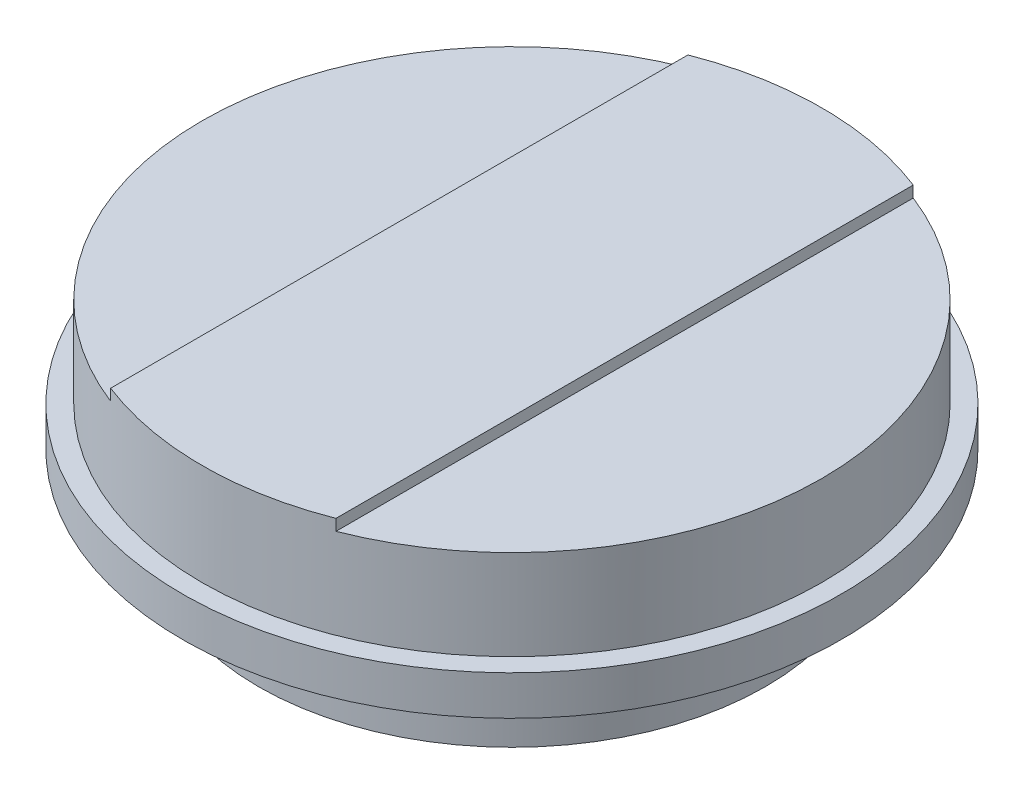
ISO-10303-21;
HEADER;
FILE_DESCRIPTION(('STEP AP214'),'2;1');
FILE_NAME('part.step','',(''),(''),'','','');
FILE_SCHEMA(('AUTOMOTIVE_DESIGN { 1 0 10303 214 1 1 1 1 }'));
ENDSEC;
DATA;
#1=APPLICATION_CONTEXT('core data for automotive mechanical design processes');
#2=APPLICATION_PROTOCOL_DEFINITION('international standard','automotive_design',2000,#1);
#3=PRODUCT_CONTEXT('',#1,'mechanical');
#4=PRODUCT('Part','Part','',(#3));
#5=PRODUCT_RELATED_PRODUCT_CATEGORY('part','',(#4));
#6=PRODUCT_DEFINITION_FORMATION('','',#4);
#7=PRODUCT_DEFINITION_CONTEXT('part definition',#1,'design');
#8=PRODUCT_DEFINITION('design','',#6,#7);
#9=PRODUCT_DEFINITION_SHAPE('','',#8);
#10=(LENGTH_UNIT() NAMED_UNIT(*) SI_UNIT(.MILLI.,.METRE.));
#11=(NAMED_UNIT(*) PLANE_ANGLE_UNIT() SI_UNIT($,.RADIAN.));
#12=(NAMED_UNIT(*) SI_UNIT($,.STERADIAN.) SOLID_ANGLE_UNIT());
#13=UNCERTAINTY_MEASURE_WITH_UNIT(LENGTH_MEASURE(1.E-05),#10,'distance_accuracy_value','');
#14=(GEOMETRIC_REPRESENTATION_CONTEXT(3) GLOBAL_UNCERTAINTY_ASSIGNED_CONTEXT((#13)) GLOBAL_UNIT_ASSIGNED_CONTEXT((#10,
#11,#12)) REPRESENTATION_CONTEXT('',''));
#15=CARTESIAN_POINT('',(0.,0.,0.));
#16=DIRECTION('',(0.,0.,1.));
#17=DIRECTION('',(1.,0.,0.));
#18=AXIS2_PLACEMENT_3D('',#15,#16,#17);
#19=CARTESIAN_POINT('',(0.,0.,0.));
#20=DIRECTION('',(0.,-1.,0.));
#21=DIRECTION('',(1.,0.,0.));
#22=AXIS2_PLACEMENT_3D('',#19,#20,#21);
#23=PLANE('',#22);
#24=DIRECTION('',(0.,0.,-1.));
#25=VECTOR('',#24,1.);
#26=CARTESIAN_POINT('',(20.,0.,-51.234753829798));
#27=LINE('',#26,#25);
#28=CARTESIAN_POINT('',(20.,0.,51.234753829798));
#29=VERTEX_POINT('',#28);
#30=CARTESIAN_POINT('',(20.,0.,-51.234753829798));
#31=VERTEX_POINT('',#30);
#32=EDGE_CURVE('E90',#29,#31,#27,.T.);
#33=ORIENTED_EDGE('',*,*,#32,.F.);
#34=CARTESIAN_POINT('',(0.,0.,0.));
#35=DIRECTION('',(0.,1.,0.));
#36=DIRECTION('',(-1.,0.,0.));
#37=AXIS2_PLACEMENT_3D('',#34,#35,#36);
#38=CIRCLE('',#37,55.);
#39=EDGE_CURVE('E11',#29,#31,#38,.T.);
#40=ORIENTED_EDGE('',*,*,#39,.T.);
#41=EDGE_LOOP('',(#33,#40));
#42=FACE_BOUND('',#41,.T.);
#43=ADVANCED_FACE('F33',(#42),#23,.F.);
#44=DIRECTION('',(0.,0.,1.));
#45=VECTOR('',#44,1.);
#46=CARTESIAN_POINT('',(-20.,0.,-51.234753829798));
#47=LINE('',#46,#45);
#48=CARTESIAN_POINT('',(-20.,0.,-51.234753829798));
#49=VERTEX_POINT('',#48);
#50=CARTESIAN_POINT('',(-20.,0.,51.234753829798));
#51=VERTEX_POINT('',#50);
#52=EDGE_CURVE('E46',#49,#51,#47,.T.);
#53=ORIENTED_EDGE('',*,*,#52,.F.);
#54=EDGE_CURVE('E36',#49,#51,#38,.T.);
#55=ORIENTED_EDGE('',*,*,#54,.T.);
#56=EDGE_LOOP('',(#53,#55));
#57=FACE_BOUND('',#56,.T.);
#58=ADVANCED_FACE('F125',(#57),#23,.F.);
#59=CARTESIAN_POINT('',(0.,84.4405133046397,0.));
#60=DIRECTION('',(0.,1.,0.));
#61=DIRECTION('',(-1.,0.,0.));
#62=AXIS2_PLACEMENT_3D('',#59,#60,#61);
#63=CYLINDRICAL_SURFACE('',#62,55.);
#64=ORIENTED_EDGE('',*,*,#39,.F.);
#65=DIRECTION('',(0.,-1.,0.));
#66=VECTOR('',#65,1.);
#67=CARTESIAN_POINT('',(20.,2.,51.234753829798));
#68=LINE('',#67,#66);
#69=CARTESIAN_POINT('',(20.,2.,51.234753829798));
#70=VERTEX_POINT('',#69);
#71=EDGE_CURVE('E99',#70,#29,#68,.T.);
#72=ORIENTED_EDGE('',*,*,#71,.F.);
#73=CARTESIAN_POINT('',(0.,2.,0.));
#74=DIRECTION('',(0.,1.,0.));
#75=DIRECTION('',(-1.,0.,0.));
#76=AXIS2_PLACEMENT_3D('',#73,#74,#75);
#77=CIRCLE('',#76,55.);
#78=CARTESIAN_POINT('',(-20.,2.,51.234753829798));
#79=VERTEX_POINT('',#78);
#80=EDGE_CURVE('E80',#79,#70,#77,.T.);
#81=ORIENTED_EDGE('',*,*,#80,.F.);
#82=DIRECTION('',(0.,-1.,0.));
#83=VECTOR('',#82,1.);
#84=CARTESIAN_POINT('',(-20.,2.,51.234753829798));
#85=LINE('',#84,#83);
#86=EDGE_CURVE('E77',#79,#51,#85,.T.);
#87=ORIENTED_EDGE('',*,*,#86,.T.);
#88=ORIENTED_EDGE('',*,*,#54,.F.);
#89=DIRECTION('',(0.,-1.,0.));
#90=VECTOR('',#89,1.);
#91=CARTESIAN_POINT('',(-20.,2.,-51.234753829798));
#92=LINE('',#91,#90);
#93=CARTESIAN_POINT('',(-20.,2.,-51.234753829798));
#94=VERTEX_POINT('',#93);
#95=EDGE_CURVE('E75',#94,#49,#92,.T.);
#96=ORIENTED_EDGE('',*,*,#95,.F.);
#97=CARTESIAN_POINT('',(0.,2.,0.));
#98=DIRECTION('',(0.,1.,0.));
#99=DIRECTION('',(1.,0.,0.));
#100=AXIS2_PLACEMENT_3D('',#97,#98,#99);
#101=CIRCLE('',#100,55.);
#102=CARTESIAN_POINT('',(20.,2.,-51.234753829798));
#103=VERTEX_POINT('',#102);
#104=EDGE_CURVE('E81',#103,#94,#101,.T.);
#105=ORIENTED_EDGE('',*,*,#104,.F.);
#106=DIRECTION('',(0.,-1.,0.));
#107=VECTOR('',#106,1.);
#108=CARTESIAN_POINT('',(20.,2.,-51.234753829798));
#109=LINE('',#108,#107);
#110=EDGE_CURVE('E130',#103,#31,#109,.T.);
#111=ORIENTED_EDGE('',*,*,#110,.T.);
#112=EDGE_LOOP('',(#64,#72,#81,#87,#88,#96,#105,#111));
#113=FACE_BOUND('',#112,.T.);
#114=CARTESIAN_POINT('',(0.,-16.,0.));
#115=DIRECTION('',(0.,1.,0.));
#116=DIRECTION('',(-1.,0.,0.));
#117=AXIS2_PLACEMENT_3D('',#114,#115,#116);
#118=CIRCLE('',#117,55.);
#119=CARTESIAN_POINT('',(-55.,-16.,0.));
#120=VERTEX_POINT('',#119);
#121=EDGE_CURVE('E122',#120,#120,#118,.T.);
#122=ORIENTED_EDGE('',*,*,#121,.T.);
#123=EDGE_LOOP('',(#122));
#124=FACE_BOUND('',#123,.T.);
#125=ADVANCED_FACE('F92',(#113,#124),#63,.T.);
#126=CARTESIAN_POINT('',(55.,-16.,0.));
#127=DIRECTION('',(0.,-1.,0.));
#128=DIRECTION('',(1.,0.,0.));
#129=AXIS2_PLACEMENT_3D('',#126,#127,#128);
#130=PLANE('',#129);
#131=ORIENTED_EDGE('',*,*,#121,.F.);
#132=EDGE_LOOP('',(#131));
#133=FACE_BOUND('',#132,.T.);
#134=CARTESIAN_POINT('',(0.,-16.,0.));
#135=DIRECTION('',(0.,1.,0.));
#136=DIRECTION('',(-1.,0.,0.));
#137=AXIS2_PLACEMENT_3D('',#134,#135,#136);
#138=CIRCLE('',#137,58.5);
#139=CARTESIAN_POINT('',(-58.5,-16.,0.));
#140=VERTEX_POINT('',#139);
#141=EDGE_CURVE('E120',#140,#140,#138,.T.);
#142=ORIENTED_EDGE('',*,*,#141,.T.);
#143=EDGE_LOOP('',(#142));
#144=FACE_BOUND('',#143,.T.);
#145=ADVANCED_FACE('F143',(#133,#144),#130,.F.);
#146=CARTESIAN_POINT('',(0.,84.4405133046397,0.));
#147=DIRECTION('',(0.,1.,0.));
#148=DIRECTION('',(-1.,0.,0.));
#149=AXIS2_PLACEMENT_3D('',#146,#147,#148);
#150=CYLINDRICAL_SURFACE('',#149,58.5);
#151=ORIENTED_EDGE('',*,*,#141,.F.);
#152=EDGE_LOOP('',(#151));
#153=FACE_BOUND('',#152,.T.);
#154=CARTESIAN_POINT('',(0.,-23.,0.));
#155=DIRECTION('',(0.,1.,0.));
#156=DIRECTION('',(-1.,0.,0.));
#157=AXIS2_PLACEMENT_3D('',#154,#155,#156);
#158=CIRCLE('',#157,58.5);
#159=CARTESIAN_POINT('',(-58.5,-23.,0.));
#160=VERTEX_POINT('',#159);
#161=EDGE_CURVE('E117',#160,#160,#158,.T.);
#162=ORIENTED_EDGE('',*,*,#161,.T.);
#163=EDGE_LOOP('',(#162));
#164=FACE_BOUND('',#163,.T.);
#165=ADVANCED_FACE('F147',(#153,#164),#150,.T.);
#166=CARTESIAN_POINT('',(58.5,-23.,0.));
#167=DIRECTION('',(0.,1.,0.));
#168=DIRECTION('',(-1.,0.,0.));
#169=AXIS2_PLACEMENT_3D('',#166,#167,#168);
#170=PLANE('',#169);
#171=ORIENTED_EDGE('',*,*,#161,.F.);
#172=EDGE_LOOP('',(#171));
#173=FACE_BOUND('',#172,.T.);
#174=CARTESIAN_POINT('',(0.,-23.,0.));
#175=DIRECTION('',(0.,1.,0.));
#176=DIRECTION('',(-1.,0.,0.));
#177=AXIS2_PLACEMENT_3D('',#174,#175,#176);
#178=CIRCLE('',#177,45.);
#179=CARTESIAN_POINT('',(-45.,-23.,0.));
#180=VERTEX_POINT('',#179);
#181=EDGE_CURVE('E114',#180,#180,#178,.T.);
#182=ORIENTED_EDGE('',*,*,#181,.T.);
#183=EDGE_LOOP('',(#182));
#184=FACE_BOUND('',#183,.T.);
#185=ADVANCED_FACE('F153',(#173,#184),#170,.F.);
#186=CARTESIAN_POINT('',(0.,84.4405133046397,0.));
#187=DIRECTION('',(0.,1.,0.));
#188=DIRECTION('',(-1.,0.,0.));
#189=AXIS2_PLACEMENT_3D('',#186,#187,#188);
#190=CYLINDRICAL_SURFACE('',#189,45.);
#191=ORIENTED_EDGE('',*,*,#181,.F.);
#192=EDGE_LOOP('',(#191));
#193=FACE_BOUND('',#192,.T.);
#194=CARTESIAN_POINT('',(0.,-37.,0.));
#195=DIRECTION('',(0.,1.,0.));
#196=DIRECTION('',(-1.,0.,0.));
#197=AXIS2_PLACEMENT_3D('',#194,#195,#196);
#198=CIRCLE('',#197,45.);
#199=CARTESIAN_POINT('',(-45.,-37.,0.));
#200=VERTEX_POINT('',#199);
#201=EDGE_CURVE('E111',#200,#200,#198,.T.);
#202=ORIENTED_EDGE('',*,*,#201,.T.);
#203=EDGE_LOOP('',(#202));
#204=FACE_BOUND('',#203,.T.);
#205=ADVANCED_FACE('F157',(#193,#204),#190,.T.);
#206=CARTESIAN_POINT('',(45.,-37.,0.));
#207=DIRECTION('',(0.,1.,0.));
#208=DIRECTION('',(-1.,0.,0.));
#209=AXIS2_PLACEMENT_3D('',#206,#207,#208);
#210=PLANE('',#209);
#211=ORIENTED_EDGE('',*,*,#201,.F.);
#212=EDGE_LOOP('',(#211));
#213=FACE_BOUND('',#212,.T.);
#214=CARTESIAN_POINT('',(0.,-37.,0.));
#215=DIRECTION('',(0.,1.,0.));
#216=DIRECTION('',(-1.,0.,0.));
#217=AXIS2_PLACEMENT_3D('',#214,#215,#216);
#218=CIRCLE('',#217,10.);
#219=CARTESIAN_POINT('',(-10.,-37.,0.));
#220=VERTEX_POINT('',#219);
#221=EDGE_CURVE('E108',#220,#220,#218,.T.);
#222=ORIENTED_EDGE('',*,*,#221,.T.);
#223=EDGE_LOOP('',(#222));
#224=FACE_BOUND('',#223,.T.);
#225=ADVANCED_FACE('F161',(#213,#224),#210,.F.);
#226=CARTESIAN_POINT('',(0.,84.4405133046397,0.));
#227=DIRECTION('',(0.,1.,0.));
#228=DIRECTION('',(-1.,0.,0.));
#229=AXIS2_PLACEMENT_3D('',#226,#227,#228);
#230=CYLINDRICAL_SURFACE('',#229,10.);
#231=ORIENTED_EDGE('',*,*,#221,.F.);
#232=EDGE_LOOP('',(#231));
#233=FACE_BOUND('',#232,.T.);
#234=CARTESIAN_POINT('',(0.,-57.,0.));
#235=DIRECTION('',(0.,1.,0.));
#236=DIRECTION('',(-1.,0.,0.));
#237=AXIS2_PLACEMENT_3D('',#234,#235,#236);
#238=CIRCLE('',#237,10.);
#239=CARTESIAN_POINT('',(-10.,-57.,0.));
#240=VERTEX_POINT('',#239);
#241=EDGE_CURVE('E105',#240,#240,#238,.T.);
#242=ORIENTED_EDGE('',*,*,#241,.T.);
#243=EDGE_LOOP('',(#242));
#244=FACE_BOUND('',#243,.T.);
#245=ADVANCED_FACE('F165',(#233,#244),#230,.T.);
#246=CARTESIAN_POINT('',(10.,-57.,0.));
#247=DIRECTION('',(0.,1.,0.));
#248=DIRECTION('',(-1.,0.,0.));
#249=AXIS2_PLACEMENT_3D('',#246,#247,#248);
#250=PLANE('',#249);
#251=ORIENTED_EDGE('',*,*,#241,.F.);
#252=EDGE_LOOP('',(#251));
#253=FACE_BOUND('',#252,.T.);
#254=CARTESIAN_POINT('',(0.,-57.,0.));
#255=DIRECTION('',(0.,1.,0.));
#256=DIRECTION('',(-1.,0.,0.));
#257=AXIS2_PLACEMENT_3D('',#254,#255,#256);
#258=CIRCLE('',#257,5.00000000000003);
#259=CARTESIAN_POINT('',(-5.00000000000004,-57.,0.));
#260=VERTEX_POINT('',#259);
#261=EDGE_CURVE('E97',#260,#260,#258,.T.);
#262=ORIENTED_EDGE('',*,*,#261,.T.);
#263=EDGE_LOOP('',(#262));
#264=FACE_BOUND('',#263,.T.);
#265=ADVANCED_FACE('F169',(#253,#264),#250,.F.);
#266=CARTESIAN_POINT('',(0.,84.4405133046397,0.));
#267=DIRECTION('',(0.,1.,0.));
#268=DIRECTION('',(-1.,0.,0.));
#269=AXIS2_PLACEMENT_3D('',#266,#267,#268);
#270=CYLINDRICAL_SURFACE('',#269,5.00000000000003);
#271=ORIENTED_EDGE('',*,*,#261,.F.);
#272=EDGE_LOOP('',(#271));
#273=FACE_BOUND('',#272,.T.);
#274=CARTESIAN_POINT('',(0.,-39.,0.));
#275=DIRECTION('',(0.,1.,0.));
#276=DIRECTION('',(-1.,0.,0.));
#277=AXIS2_PLACEMENT_3D('',#274,#275,#276);
#278=CIRCLE('',#277,5.00000000000003);
#279=CARTESIAN_POINT('',(-5.00000000000003,-39.,0.));
#280=VERTEX_POINT('',#279);
#281=EDGE_CURVE('E94',#280,#280,#278,.T.);
#282=ORIENTED_EDGE('',*,*,#281,.T.);
#283=EDGE_LOOP('',(#282));
#284=FACE_BOUND('',#283,.T.);
#285=ADVANCED_FACE('F173',(#273,#284),#270,.F.);
#286=CARTESIAN_POINT('',(5.00000000000002,-39.,0.));
#287=DIRECTION('',(0.,1.,0.));
#288=DIRECTION('',(-1.,0.,0.));
#289=AXIS2_PLACEMENT_3D('',#286,#287,#288);
#290=PLANE('',#289);
#291=ORIENTED_EDGE('',*,*,#281,.F.);
#292=EDGE_LOOP('',(#291));
#293=FACE_BOUND('',#292,.T.);
#294=ADVANCED_FACE('F177',(#293),#290,.F.);
#295=CARTESIAN_POINT('',(-20.,2.,-51.234753829798));
#296=DIRECTION('',(1.,0.,0.));
#297=DIRECTION('',(0.,1.,0.));
#298=AXIS2_PLACEMENT_3D('',#295,#296,#297);
#299=PLANE('',#298);
#300=ORIENTED_EDGE('',*,*,#52,.T.);
#301=ORIENTED_EDGE('',*,*,#86,.F.);
#302=DIRECTION('',(0.,0.,1.));
#303=VECTOR('',#302,1.);
#304=CARTESIAN_POINT('',(-20.,2.,-51.234753829798));
#305=LINE('',#304,#303);
#306=EDGE_CURVE('E71',#94,#79,#305,.T.);
#307=ORIENTED_EDGE('',*,*,#306,.F.);
#308=ORIENTED_EDGE('',*,*,#95,.T.);
#309=EDGE_LOOP('',(#300,#301,#307,#308));
#310=FACE_BOUND('',#309,.T.);
#311=ADVANCED_FACE('F73',(#310),#299,.F.);
#312=CARTESIAN_POINT('',(20.,2.,-51.234753829798));
#313=DIRECTION('',(-1.,0.,0.));
#314=DIRECTION('',(0.,-1.,0.));
#315=AXIS2_PLACEMENT_3D('',#312,#313,#314);
#316=PLANE('',#315);
#317=ORIENTED_EDGE('',*,*,#32,.T.);
#318=ORIENTED_EDGE('',*,*,#110,.F.);
#319=DIRECTION('',(0.,0.,-1.));
#320=VECTOR('',#319,1.);
#321=CARTESIAN_POINT('',(20.,2.,-51.234753829798));
#322=LINE('',#321,#320);
#323=EDGE_CURVE('E86',#70,#103,#322,.T.);
#324=ORIENTED_EDGE('',*,*,#323,.F.);
#325=ORIENTED_EDGE('',*,*,#71,.T.);
#326=EDGE_LOOP('',(#317,#318,#324,#325));
#327=FACE_BOUND('',#326,.T.);
#328=ADVANCED_FACE('F135',(#327),#316,.F.);
#329=CARTESIAN_POINT('',(0.,2.,0.));
#330=DIRECTION('',(0.,-1.,0.));
#331=DIRECTION('',(1.,0.,0.));
#332=AXIS2_PLACEMENT_3D('',#329,#330,#331);
#333=PLANE('',#332);
#334=ORIENTED_EDGE('',*,*,#104,.T.);
#335=ORIENTED_EDGE('',*,*,#306,.T.);
#336=ORIENTED_EDGE('',*,*,#80,.T.);
#337=ORIENTED_EDGE('',*,*,#323,.T.);
#338=EDGE_LOOP('',(#334,#335,#336,#337));
#339=FACE_BOUND('',#338,.T.);
#340=ADVANCED_FACE('F84',(#339),#333,.F.);
#341=CLOSED_SHELL('',(#43,#58,#125,#145,#165,#185,#205,#225,#245,#265,#285,#294,#311,#328,#340));
#342=MANIFOLD_SOLID_BREP('B2',#341);
#343=ADVANCED_BREP_SHAPE_REPRESENTATION('',(#18,#342),#14);
#344=SHAPE_DEFINITION_REPRESENTATION(#9,#343);
ENDSEC;
END-ISO-10303-21;
